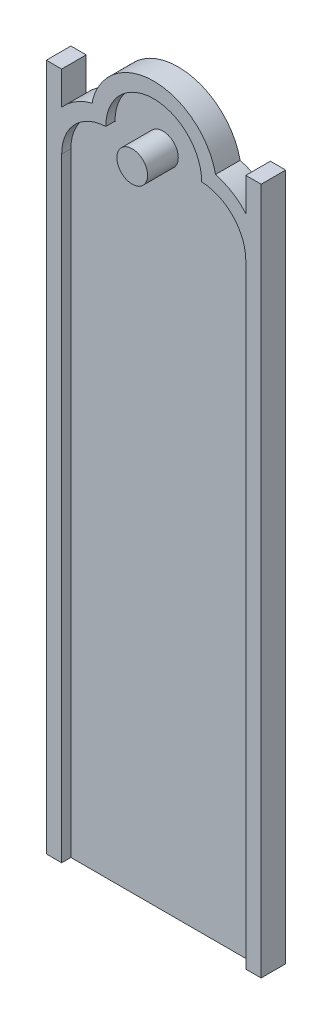
ISO-10303-21;
HEADER;
FILE_DESCRIPTION(('STEP AP214'),'2;1');
FILE_NAME('part.step','',(''),(''),'','','');
FILE_SCHEMA(('AUTOMOTIVE_DESIGN { 1 0 10303 214 1 1 1 1 }'));
ENDSEC;
DATA;
#1=APPLICATION_CONTEXT('core data for automotive mechanical design processes');
#2=APPLICATION_PROTOCOL_DEFINITION('international standard','automotive_design',2000,#1);
#3=PRODUCT_CONTEXT('',#1,'mechanical');
#4=PRODUCT('Part','Part','',(#3));
#5=PRODUCT_RELATED_PRODUCT_CATEGORY('part','',(#4));
#6=PRODUCT_DEFINITION_FORMATION('','',#4);
#7=PRODUCT_DEFINITION_CONTEXT('part definition',#1,'design');
#8=PRODUCT_DEFINITION('design','',#6,#7);
#9=PRODUCT_DEFINITION_SHAPE('','',#8);
#10=(LENGTH_UNIT() NAMED_UNIT(*) SI_UNIT(.MILLI.,.METRE.));
#11=(NAMED_UNIT(*) PLANE_ANGLE_UNIT() SI_UNIT($,.RADIAN.));
#12=(NAMED_UNIT(*) SI_UNIT($,.STERADIAN.) SOLID_ANGLE_UNIT());
#13=UNCERTAINTY_MEASURE_WITH_UNIT(LENGTH_MEASURE(1.E-05),#10,'distance_accuracy_value','');
#14=(GEOMETRIC_REPRESENTATION_CONTEXT(3) GLOBAL_UNCERTAINTY_ASSIGNED_CONTEXT((#13)) GLOBAL_UNIT_ASSIGNED_CONTEXT((#10,
#11,#12)) REPRESENTATION_CONTEXT('',''));
#15=CARTESIAN_POINT('',(0.,0.,0.));
#16=DIRECTION('',(0.,0.,1.));
#17=DIRECTION('',(1.,0.,0.));
#18=AXIS2_PLACEMENT_3D('',#15,#16,#17);
#19=CARTESIAN_POINT('',(0.,637.937190164897,50.));
#20=DIRECTION('',(0.,1.,0.));
#21=DIRECTION('',(0.,0.,1.));
#22=AXIS2_PLACEMENT_3D('',#19,#20,#21);
#23=PLANE('',#22);
#24=DIRECTION('',(1.,0.,0.));
#25=VECTOR('',#24,1.);
#26=CARTESIAN_POINT('',(0.,637.937190164897,0.));
#27=LINE('',#26,#25);
#28=CARTESIAN_POINT('',(166.218098660112,637.937190164897,0.));
#29=VERTEX_POINT('',#28);
#30=CARTESIAN_POINT('',(172.373379940995,637.937190164897,0.));
#31=VERTEX_POINT('',#30);
#32=EDGE_CURVE('E369',#29,#31,#27,.T.);
#33=ORIENTED_EDGE('',*,*,#32,.T.);
#34=DIRECTION('',(0.,0.,-1.));
#35=VECTOR('',#34,1.);
#36=CARTESIAN_POINT('',(172.373379940995,637.937190164897,50.));
#37=LINE('',#36,#35);
#38=CARTESIAN_POINT('',(172.373379940995,637.937190164897,50.));
#39=VERTEX_POINT('',#38);
#40=EDGE_CURVE('E11',#39,#31,#37,.T.);
#41=ORIENTED_EDGE('',*,*,#40,.F.);
#42=DIRECTION('',(1.,0.,0.));
#43=VECTOR('',#42,1.);
#44=CARTESIAN_POINT('',(0.,637.937190164897,50.));
#45=LINE('',#44,#43);
#46=CARTESIAN_POINT('',(166.218098660112,637.937190164897,50.));
#47=VERTEX_POINT('',#46);
#48=EDGE_CURVE('E374',#47,#39,#45,.T.);
#49=ORIENTED_EDGE('',*,*,#48,.F.);
#50=DIRECTION('',(0.,0.,-1.));
#51=VECTOR('',#50,1.);
#52=CARTESIAN_POINT('',(166.218098660112,637.937190164897,50.));
#53=LINE('',#52,#51);
#54=EDGE_CURVE('E403',#47,#29,#53,.T.);
#55=ORIENTED_EDGE('',*,*,#54,.T.);
#56=EDGE_LOOP('',(#33,#41,#49,#55));
#57=FACE_BOUND('',#56,.T.);
#58=ADVANCED_FACE('F44',(#57),#23,.F.);
#59=CARTESIAN_POINT('',(0.,637.937190164897,50.));
#60=DIRECTION('',(0.,-1.,0.));
#61=DIRECTION('',(0.,0.,-1.));
#62=AXIS2_PLACEMENT_3D('',#59,#60,#61);
#63=PLANE('',#62);
#64=DIRECTION('',(-1.,0.,0.));
#65=VECTOR('',#64,1.);
#66=CARTESIAN_POINT('',(0.,637.937190164897,0.));
#67=LINE('',#66,#65);
#68=CARTESIAN_POINT('',(-133.781901339888,637.937190164897,0.));
#69=VERTEX_POINT('',#68);
#70=CARTESIAN_POINT('',(-139.937182620771,637.937190164897,0.));
#71=VERTEX_POINT('',#70);
#72=EDGE_CURVE('E406',#69,#71,#67,.T.);
#73=ORIENTED_EDGE('',*,*,#72,.F.);
#74=DIRECTION('',(0.,0.,-1.));
#75=VECTOR('',#74,1.);
#76=CARTESIAN_POINT('',(-133.781901339888,637.937190164897,50.));
#77=LINE('',#76,#75);
#78=CARTESIAN_POINT('',(-133.781901339888,637.937190164897,50.));
#79=VERTEX_POINT('',#78);
#80=EDGE_CURVE('E419',#79,#69,#77,.T.);
#81=ORIENTED_EDGE('',*,*,#80,.F.);
#82=DIRECTION('',(-1.,0.,0.));
#83=VECTOR('',#82,1.);
#84=CARTESIAN_POINT('',(0.,637.937190164897,50.));
#85=LINE('',#84,#83);
#86=CARTESIAN_POINT('',(-139.937182620771,637.937190164897,50.));
#87=VERTEX_POINT('',#86);
#88=EDGE_CURVE('E381',#79,#87,#85,.T.);
#89=ORIENTED_EDGE('',*,*,#88,.T.);
#90=DIRECTION('',(0.,0.,-1.));
#91=VECTOR('',#90,1.);
#92=CARTESIAN_POINT('',(-139.937182620771,637.937190164897,50.));
#93=LINE('',#92,#91);
#94=EDGE_CURVE('E52',#87,#71,#93,.T.);
#95=ORIENTED_EDGE('',*,*,#94,.T.);
#96=EDGE_LOOP('',(#73,#81,#89,#95));
#97=FACE_BOUND('',#96,.T.);
#98=ADVANCED_FACE('F427',(#97),#63,.T.);
#99=CARTESIAN_POINT('',(-133.781901339888,487.937190164897,50.));
#100=DIRECTION('',(0.,0.,-1.));
#101=DIRECTION('',(-1.,0.,0.));
#102=AXIS2_PLACEMENT_3D('',#99,#100,#101);
#103=CYLINDRICAL_SURFACE('',#102,150.);
#104=CARTESIAN_POINT('',(-133.781901339888,487.937190164897,0.));
#105=DIRECTION('',(0.,0.,1.));
#106=DIRECTION('',(1.,0.,0.));
#107=AXIS2_PLACEMENT_3D('',#104,#105,#106);
#108=CIRCLE('',#107,150.);
#109=CARTESIAN_POINT('',(-139.93713150982,637.810847428457,0.));
#110=VERTEX_POINT('',#109);
#111=EDGE_CURVE('E64',#69,#110,#108,.T.);
#112=ORIENTED_EDGE('',*,*,#111,.T.);
#113=DIRECTION('',(0.,0.,-1.));
#114=VECTOR('',#113,1.);
#115=CARTESIAN_POINT('',(-139.93713150982,637.810847428457,80.));
#116=LINE('',#115,#114);
#117=CARTESIAN_POINT('',(-139.93713150982,637.810847428457,50.));
#118=VERTEX_POINT('',#117);
#119=EDGE_CURVE('E59',#118,#110,#116,.T.);
#120=ORIENTED_EDGE('',*,*,#119,.F.);
#121=CARTESIAN_POINT('',(-133.781901339888,487.937190164897,50.));
#122=DIRECTION('',(0.,0.,1.));
#123=DIRECTION('',(1.,0.,0.));
#124=AXIS2_PLACEMENT_3D('',#121,#122,#123);
#125=CIRCLE('',#124,150.);
#126=EDGE_CURVE('E385',#79,#118,#125,.T.);
#127=ORIENTED_EDGE('',*,*,#126,.F.);
#128=ORIENTED_EDGE('',*,*,#80,.T.);
#129=EDGE_LOOP('',(#112,#120,#127,#128));
#130=FACE_BOUND('',#129,.T.);
#131=ADVANCED_FACE('F455',(#130),#103,.T.);
#132=CARTESIAN_POINT('',(0.,-1512.0628098351,50.));
#133=DIRECTION('',(0.,1.,0.));
#134=DIRECTION('',(0.,0.,1.));
#135=AXIS2_PLACEMENT_3D('',#132,#133,#134);
#136=PLANE('',#135);
#137=DIRECTION('',(1.,0.,0.));
#138=VECTOR('',#137,1.);
#139=CARTESIAN_POINT('',(0.,-1512.0628098351,0.));
#140=LINE('',#139,#138);
#141=CARTESIAN_POINT('',(-333.781901339888,-1512.0628098351,0.));
#142=VERTEX_POINT('',#141);
#143=CARTESIAN_POINT('',(366.218098660112,-1512.0628098351,0.));
#144=VERTEX_POINT('',#143);
#145=EDGE_CURVE('E411',#142,#144,#140,.T.);
#146=ORIENTED_EDGE('',*,*,#145,.T.);
#147=DIRECTION('',(0.,0.,-1.));
#148=VECTOR('',#147,1.);
#149=CARTESIAN_POINT('',(366.218098660112,-1512.0628098351,80.));
#150=LINE('',#149,#148);
#151=CARTESIAN_POINT('',(366.218098660112,-1512.0628098351,80.));
#152=VERTEX_POINT('',#151);
#153=EDGE_CURVE('E356',#152,#144,#150,.T.);
#154=ORIENTED_EDGE('',*,*,#153,.F.);
#155=DIRECTION('',(1.,0.,0.));
#156=VECTOR('',#155,1.);
#157=CARTESIAN_POINT('',(0.,-1512.0628098351,80.));
#158=LINE('',#157,#156);
#159=CARTESIAN_POINT('',(316.218098660112,-1512.0628098351,80.));
#160=VERTEX_POINT('',#159);
#161=EDGE_CURVE('E225',#160,#152,#158,.T.);
#162=ORIENTED_EDGE('',*,*,#161,.F.);
#163=DIRECTION('',(0.,0.,-1.));
#164=VECTOR('',#163,1.);
#165=CARTESIAN_POINT('',(316.218098660112,-1512.0628098351,80.));
#166=LINE('',#165,#164);
#167=CARTESIAN_POINT('',(316.218098660112,-1512.0628098351,50.));
#168=VERTEX_POINT('',#167);
#169=EDGE_CURVE('E360',#160,#168,#166,.T.);
#170=ORIENTED_EDGE('',*,*,#169,.T.);
#171=DIRECTION('',(1.,0.,0.));
#172=VECTOR('',#171,1.);
#173=CARTESIAN_POINT('',(0.,-1512.0628098351,50.));
#174=LINE('',#173,#172);
#175=CARTESIAN_POINT('',(-283.781901339888,-1512.0628098351,50.));
#176=VERTEX_POINT('',#175);
#177=EDGE_CURVE('E391',#176,#168,#174,.T.);
#178=ORIENTED_EDGE('',*,*,#177,.F.);
#179=DIRECTION('',(0.,0.,-1.));
#180=VECTOR('',#179,1.);
#181=CARTESIAN_POINT('',(-283.781901339888,-1512.0628098351,80.));
#182=LINE('',#181,#180);
#183=CARTESIAN_POINT('',(-283.781901339888,-1512.0628098351,80.));
#184=VERTEX_POINT('',#183);
#185=EDGE_CURVE('E315',#184,#176,#182,.T.);
#186=ORIENTED_EDGE('',*,*,#185,.F.);
#187=CARTESIAN_POINT('',(-333.781901339888,-1512.0628098351,80.));
#188=VERTEX_POINT('',#187);
#189=EDGE_CURVE('E232',#188,#184,#158,.T.);
#190=ORIENTED_EDGE('',*,*,#189,.F.);
#191=DIRECTION('',(0.,0.,-1.));
#192=VECTOR('',#191,1.);
#193=CARTESIAN_POINT('',(-333.781901339888,-1512.0628098351,80.));
#194=LINE('',#193,#192);
#195=EDGE_CURVE('E319',#188,#142,#194,.T.);
#196=ORIENTED_EDGE('',*,*,#195,.T.);
#197=EDGE_LOOP('',(#146,#154,#162,#170,#178,#186,#190,#196));
#198=FACE_BOUND('',#197,.T.);
#199=ADVANCED_FACE('F474',(#198),#136,.F.);
#200=CARTESIAN_POINT('',(166.218098660112,487.937190164897,50.));
#201=DIRECTION('',(0.,0.,-1.));
#202=DIRECTION('',(-1.,0.,0.));
#203=AXIS2_PLACEMENT_3D('',#200,#201,#202);
#204=CYLINDRICAL_SURFACE('',#203,150.);
#205=CARTESIAN_POINT('',(166.218098660112,487.937190164897,50.));
#206=DIRECTION('',(0.,0.,1.));
#207=DIRECTION('',(1.,0.,0.));
#208=AXIS2_PLACEMENT_3D('',#205,#206,#207);
#209=CIRCLE('',#208,150.);
#210=CARTESIAN_POINT('',(172.373328830045,637.810847428457,50.));
#211=VERTEX_POINT('',#210);
#212=EDGE_CURVE('E398',#211,#47,#209,.T.);
#213=ORIENTED_EDGE('',*,*,#212,.F.);
#214=DIRECTION('',(0.,0.,-1.));
#215=VECTOR('',#214,1.);
#216=CARTESIAN_POINT('',(172.373328830045,637.810847428457,80.));
#217=LINE('',#216,#215);
#218=CARTESIAN_POINT('',(172.373328830045,637.810847428457,0.));
#219=VERTEX_POINT('',#218);
#220=EDGE_CURVE('E200',#211,#219,#217,.T.);
#221=ORIENTED_EDGE('',*,*,#220,.T.);
#222=CARTESIAN_POINT('',(166.218098660112,487.937190164897,0.));
#223=DIRECTION('',(0.,0.,1.));
#224=DIRECTION('',(1.,0.,0.));
#225=AXIS2_PLACEMENT_3D('',#222,#223,#224);
#226=CIRCLE('',#225,150.);
#227=EDGE_CURVE('E375',#219,#29,#226,.T.);
#228=ORIENTED_EDGE('',*,*,#227,.T.);
#229=ORIENTED_EDGE('',*,*,#54,.F.);
#230=EDGE_LOOP('',(#213,#221,#228,#229));
#231=FACE_BOUND('',#230,.T.);
#232=ADVANCED_FACE('F465',(#231),#204,.T.);
#233=CARTESIAN_POINT('',(0.,0.,50.));
#234=DIRECTION('',(0.,0.,1.));
#235=DIRECTION('',(1.,0.,0.));
#236=AXIS2_PLACEMENT_3D('',#233,#234,#235);
#237=PLANE('',#236);
#238=CARTESIAN_POINT('',(16.2180986601124,637.937190164897,50.));
#239=DIRECTION('',(0.,0.,1.));
#240=DIRECTION('',(1.,0.,0.));
#241=AXIS2_PLACEMENT_3D('',#238,#239,#240);
#242=CIRCLE('',#241,50.);
#243=CARTESIAN_POINT('',(66.2180986601123,637.937190164897,50.));
#244=VERTEX_POINT('',#243);
#245=EDGE_CURVE('E370',#244,#244,#242,.T.);
#246=ORIENTED_EDGE('',*,*,#245,.F.);
#247=EDGE_LOOP('',(#246));
#248=FACE_BOUND('',#247,.T.);
#249=ORIENTED_EDGE('',*,*,#48,.T.);
#250=CARTESIAN_POINT('',(16.2180986601124,637.937190164897,50.));
#251=DIRECTION('',(0.,0.,1.));
#252=DIRECTION('',(1.,0.,0.));
#253=AXIS2_PLACEMENT_3D('',#250,#251,#252);
#254=CIRCLE('',#253,156.155281280883);
#255=EDGE_CURVE('E378',#39,#87,#254,.T.);
#256=ORIENTED_EDGE('',*,*,#255,.T.);
#257=ORIENTED_EDGE('',*,*,#88,.F.);
#258=ORIENTED_EDGE('',*,*,#126,.T.);
#259=CARTESIAN_POINT('',(-133.781901339888,487.937190164897,50.));
#260=DIRECTION('',(0.,0.,1.));
#261=DIRECTION('',(1.,0.,0.));
#262=AXIS2_PLACEMENT_3D('',#259,#260,#261);
#263=CIRCLE('',#262,150.);
#264=CARTESIAN_POINT('',(-283.781901339888,487.937190164897,50.));
#265=VERTEX_POINT('',#264);
#266=EDGE_CURVE('E205',#265,#118,#263,.F.);
#267=ORIENTED_EDGE('',*,*,#266,.F.);
#268=DIRECTION('',(0.,-1.,0.));
#269=VECTOR('',#268,1.);
#270=CARTESIAN_POINT('',(-283.781901339888,0.,50.));
#271=LINE('',#270,#269);
#272=EDGE_CURVE('E388',#265,#176,#271,.T.);
#273=ORIENTED_EDGE('',*,*,#272,.T.);
#274=ORIENTED_EDGE('',*,*,#177,.T.);
#275=DIRECTION('',(0.,-1.,0.));
#276=VECTOR('',#275,1.);
#277=CARTESIAN_POINT('',(316.218098660112,0.,50.));
#278=LINE('',#277,#276);
#279=CARTESIAN_POINT('',(316.218098660112,487.937190164897,50.));
#280=VERTEX_POINT('',#279);
#281=EDGE_CURVE('E395',#280,#168,#278,.T.);
#282=ORIENTED_EDGE('',*,*,#281,.F.);
#283=EDGE_CURVE('E399',#280,#211,#209,.T.);
#284=ORIENTED_EDGE('',*,*,#283,.T.);
#285=ORIENTED_EDGE('',*,*,#212,.T.);
#286=EDGE_LOOP('',(#249,#256,#257,#258,#267,#273,#274,#282,#284,#285));
#287=FACE_BOUND('',#286,.T.);
#288=ADVANCED_FACE('F480',(#248,#287),#237,.T.);
#289=CARTESIAN_POINT('',(0.,0.,0.));
#290=DIRECTION('',(0.,0.,1.));
#291=DIRECTION('',(1.,0.,0.));
#292=AXIS2_PLACEMENT_3D('',#289,#290,#291);
#293=PLANE('',#292);
#294=ORIENTED_EDGE('',*,*,#72,.T.);
#295=CARTESIAN_POINT('',(16.2180986601124,637.937190164897,0.));
#296=DIRECTION('',(0.,0.,1.));
#297=DIRECTION('',(1.,0.,0.));
#298=AXIS2_PLACEMENT_3D('',#295,#296,#297);
#299=CIRCLE('',#298,156.155281280883);
#300=EDGE_CURVE('E275',#71,#110,#299,.T.);
#301=ORIENTED_EDGE('',*,*,#300,.T.);
#302=ORIENTED_EDGE('',*,*,#111,.F.);
#303=EDGE_LOOP('',(#294,#301,#302));
#304=FACE_BOUND('',#303,.T.);
#305=ORIENTED_EDGE('',*,*,#227,.F.);
#306=EDGE_CURVE('E270',#219,#31,#299,.T.);
#307=ORIENTED_EDGE('',*,*,#306,.T.);
#308=ORIENTED_EDGE('',*,*,#32,.F.);
#309=EDGE_LOOP('',(#305,#307,#308));
#310=FACE_BOUND('',#309,.T.);
#311=DIRECTION('',(0.,1.,0.));
#312=VECTOR('',#311,1.);
#313=CARTESIAN_POINT('',(366.218098660112,0.,0.));
#314=LINE('',#313,#312);
#315=CARTESIAN_POINT('',(366.218098660112,727.937190164897,0.));
#316=VERTEX_POINT('',#315);
#317=EDGE_CURVE('E274',#144,#316,#314,.T.);
#318=ORIENTED_EDGE('',*,*,#317,.F.);
#319=ORIENTED_EDGE('',*,*,#145,.F.);
#320=DIRECTION('',(0.,1.,0.));
#321=VECTOR('',#320,1.);
#322=CARTESIAN_POINT('',(-333.781901339888,0.,0.));
#323=LINE('',#322,#321);
#324=CARTESIAN_POINT('',(-333.781901339888,727.937190164897,0.));
#325=VERTEX_POINT('',#324);
#326=EDGE_CURVE('E215',#142,#325,#323,.T.);
#327=ORIENTED_EDGE('',*,*,#326,.T.);
#328=DIRECTION('',(-1.,0.,0.));
#329=VECTOR('',#328,1.);
#330=CARTESIAN_POINT('',(0.,727.937190164897,0.));
#331=LINE('',#330,#329);
#332=CARTESIAN_POINT('',(-283.781901339888,727.937190164897,0.));
#333=VERTEX_POINT('',#332);
#334=EDGE_CURVE('E301',#333,#325,#331,.T.);
#335=ORIENTED_EDGE('',*,*,#334,.F.);
#336=DIRECTION('',(0.,-1.,0.));
#337=VECTOR('',#336,1.);
#338=CARTESIAN_POINT('',(-283.781901339888,0.,0.));
#339=LINE('',#338,#337);
#340=CARTESIAN_POINT('',(-283.781901339888,620.224755718126,0.));
#341=VERTEX_POINT('',#340);
#342=EDGE_CURVE('E297',#333,#341,#339,.T.);
#343=ORIENTED_EDGE('',*,*,#342,.T.);
#344=CARTESIAN_POINT('',(-133.781901339888,487.937190164897,0.));
#345=DIRECTION('',(0.,0.,1.));
#346=DIRECTION('',(1.,0.,0.));
#347=AXIS2_PLACEMENT_3D('',#344,#345,#346);
#348=CIRCLE('',#347,200.);
#349=CARTESIAN_POINT('',(-183.781901339888,681.586357475267,0.));
#350=VERTEX_POINT('',#349);
#351=EDGE_CURVE('E293',#350,#341,#348,.T.);
#352=ORIENTED_EDGE('',*,*,#351,.F.);
#353=DIRECTION('',(0.,-1.,0.));
#354=VECTOR('',#353,1.);
#355=CARTESIAN_POINT('',(-183.781901339888,0.,0.));
#356=LINE('',#355,#354);
#357=CARTESIAN_POINT('',(-183.781901339888,687.937190164897,0.));
#358=VERTEX_POINT('',#357);
#359=EDGE_CURVE('E290',#358,#350,#356,.T.);
#360=ORIENTED_EDGE('',*,*,#359,.F.);
#361=CARTESIAN_POINT('',(16.2180986601124,637.937190164897,0.));
#362=DIRECTION('',(0.,0.,1.));
#363=DIRECTION('',(1.,0.,0.));
#364=AXIS2_PLACEMENT_3D('',#361,#362,#363);
#365=CIRCLE('',#364,206.155281280883);
#366=CARTESIAN_POINT('',(217.788355506516,681.174113677966,0.));
#367=VERTEX_POINT('',#366);
#368=EDGE_CURVE('E287',#367,#358,#365,.T.);
#369=ORIENTED_EDGE('',*,*,#368,.F.);
#370=CARTESIAN_POINT('',(166.218098660112,487.937190164897,0.));
#371=DIRECTION('',(0.,0.,1.));
#372=DIRECTION('',(1.,0.,0.));
#373=AXIS2_PLACEMENT_3D('',#370,#371,#372);
#374=CIRCLE('',#373,200.);
#375=CARTESIAN_POINT('',(316.218098660112,620.224755718126,0.));
#376=VERTEX_POINT('',#375);
#377=EDGE_CURVE('E284',#376,#367,#374,.T.);
#378=ORIENTED_EDGE('',*,*,#377,.F.);
#379=DIRECTION('',(0.,-1.,0.));
#380=VECTOR('',#379,1.);
#381=CARTESIAN_POINT('',(316.218098660112,0.,0.));
#382=LINE('',#381,#380);
#383=CARTESIAN_POINT('',(316.218098660112,727.937190164897,0.));
#384=VERTEX_POINT('',#383);
#385=EDGE_CURVE('E281',#384,#376,#382,.T.);
#386=ORIENTED_EDGE('',*,*,#385,.F.);
#387=DIRECTION('',(-1.,0.,0.));
#388=VECTOR('',#387,1.);
#389=CARTESIAN_POINT('',(0.,727.937190164897,0.));
#390=LINE('',#389,#388);
#391=EDGE_CURVE('E278',#316,#384,#390,.T.);
#392=ORIENTED_EDGE('',*,*,#391,.F.);
#393=EDGE_LOOP('',(#318,#319,#327,#335,#343,#352,#360,#369,#378,#386,#392));
#394=FACE_BOUND('',#393,.T.);
#395=ADVANCED_FACE('F462',(#304,#310,#394),#293,.F.);
#396=CARTESIAN_POINT('',(16.2180986601124,637.937190164897,80.));
#397=DIRECTION('',(0.,0.,-1.));
#398=DIRECTION('',(-1.,0.,0.));
#399=AXIS2_PLACEMENT_3D('',#396,#397,#398);
#400=CYLINDRICAL_SURFACE('',#399,156.155281280883);
#401=ORIENTED_EDGE('',*,*,#40,.T.);
#402=ORIENTED_EDGE('',*,*,#306,.F.);
#403=ORIENTED_EDGE('',*,*,#220,.F.);
#404=CARTESIAN_POINT('',(172.373328830045,637.810847428457,80.));
#405=VERTEX_POINT('',#404);
#406=EDGE_CURVE('E193',#405,#211,#217,.T.);
#407=ORIENTED_EDGE('',*,*,#406,.F.);
#408=CARTESIAN_POINT('',(16.2180986601124,637.937190164897,80.));
#409=DIRECTION('',(0.,0.,1.));
#410=DIRECTION('',(1.,0.,0.));
#411=AXIS2_PLACEMENT_3D('',#408,#409,#410);
#412=CIRCLE('',#411,156.155281280883);
#413=CARTESIAN_POINT('',(-139.93713150982,637.810847428457,80.));
#414=VERTEX_POINT('',#413);
#415=EDGE_CURVE('E197',#405,#414,#412,.T.);
#416=ORIENTED_EDGE('',*,*,#415,.T.);
#417=EDGE_CURVE('E308',#414,#118,#116,.T.);
#418=ORIENTED_EDGE('',*,*,#417,.T.);
#419=ORIENTED_EDGE('',*,*,#119,.T.);
#420=ORIENTED_EDGE('',*,*,#300,.F.);
#421=ORIENTED_EDGE('',*,*,#94,.F.);
#422=ORIENTED_EDGE('',*,*,#255,.F.);
#423=EDGE_LOOP('',(#401,#402,#403,#407,#416,#418,#419,#420,#421,#422));
#424=FACE_BOUND('',#423,.T.);
#425=ADVANCED_FACE('F195',(#424),#400,.F.);
#426=CARTESIAN_POINT('',(166.218098660112,487.937190164897,80.));
#427=DIRECTION('',(0.,0.,-1.));
#428=DIRECTION('',(-1.,0.,0.));
#429=AXIS2_PLACEMENT_3D('',#426,#427,#428);
#430=CYLINDRICAL_SURFACE('',#429,150.);
#431=ORIENTED_EDGE('',*,*,#406,.T.);
#432=ORIENTED_EDGE('',*,*,#283,.F.);
#433=DIRECTION('',(0.,0.,-1.));
#434=VECTOR('',#433,1.);
#435=CARTESIAN_POINT('',(316.218098660112,487.937190164897,80.));
#436=LINE('',#435,#434);
#437=CARTESIAN_POINT('',(316.218098660112,487.937190164897,80.));
#438=VERTEX_POINT('',#437);
#439=EDGE_CURVE('E219',#438,#280,#436,.T.);
#440=ORIENTED_EDGE('',*,*,#439,.F.);
#441=CARTESIAN_POINT('',(166.218098660112,487.937190164897,80.));
#442=DIRECTION('',(0.,0.,1.));
#443=DIRECTION('',(1.,0.,0.));
#444=AXIS2_PLACEMENT_3D('',#441,#442,#443);
#445=CIRCLE('',#444,150.);
#446=EDGE_CURVE('E210',#438,#405,#445,.T.);
#447=ORIENTED_EDGE('',*,*,#446,.T.);
#448=EDGE_LOOP('',(#431,#432,#440,#447));
#449=FACE_BOUND('',#448,.T.);
#450=ADVANCED_FACE('F217',(#449),#430,.F.);
#451=CARTESIAN_POINT('',(316.218098660112,0.,80.));
#452=DIRECTION('',(1.,0.,0.));
#453=DIRECTION('',(0.,0.,-1.));
#454=AXIS2_PLACEMENT_3D('',#451,#452,#453);
#455=PLANE('',#454);
#456=ORIENTED_EDGE('',*,*,#281,.T.);
#457=ORIENTED_EDGE('',*,*,#169,.F.);
#458=DIRECTION('',(0.,-1.,0.));
#459=VECTOR('',#458,1.);
#460=CARTESIAN_POINT('',(316.218098660112,0.,80.));
#461=LINE('',#460,#459);
#462=EDGE_CURVE('E222',#438,#160,#461,.T.);
#463=ORIENTED_EDGE('',*,*,#462,.F.);
#464=ORIENTED_EDGE('',*,*,#439,.T.);
#465=EDGE_LOOP('',(#456,#457,#463,#464));
#466=FACE_BOUND('',#465,.T.);
#467=ADVANCED_FACE('F531',(#466),#455,.F.);
#468=CARTESIAN_POINT('',(366.218098660112,0.,80.));
#469=DIRECTION('',(-1.,0.,0.));
#470=DIRECTION('',(0.,0.,1.));
#471=AXIS2_PLACEMENT_3D('',#468,#469,#470);
#472=PLANE('',#471);
#473=ORIENTED_EDGE('',*,*,#317,.T.);
#474=DIRECTION('',(0.,0.,-1.));
#475=VECTOR('',#474,1.);
#476=CARTESIAN_POINT('',(366.218098660112,727.937190164897,80.));
#477=LINE('',#476,#475);
#478=CARTESIAN_POINT('',(366.218098660112,727.937190164897,80.));
#479=VERTEX_POINT('',#478);
#480=EDGE_CURVE('E352',#479,#316,#477,.T.);
#481=ORIENTED_EDGE('',*,*,#480,.F.);
#482=DIRECTION('',(0.,1.,0.));
#483=VECTOR('',#482,1.);
#484=CARTESIAN_POINT('',(366.218098660112,0.,80.));
#485=LINE('',#484,#483);
#486=EDGE_CURVE('E231',#152,#479,#485,.T.);
#487=ORIENTED_EDGE('',*,*,#486,.F.);
#488=ORIENTED_EDGE('',*,*,#153,.T.);
#489=EDGE_LOOP('',(#473,#481,#487,#488));
#490=FACE_BOUND('',#489,.T.);
#491=ADVANCED_FACE('F542',(#490),#472,.F.);
#492=CARTESIAN_POINT('',(0.,727.937190164897,80.));
#493=DIRECTION('',(0.,-1.,0.));
#494=DIRECTION('',(0.,0.,-1.));
#495=AXIS2_PLACEMENT_3D('',#492,#493,#494);
#496=PLANE('',#495);
#497=ORIENTED_EDGE('',*,*,#391,.T.);
#498=DIRECTION('',(0.,0.,-1.));
#499=VECTOR('',#498,1.);
#500=CARTESIAN_POINT('',(316.218098660112,727.937190164897,80.));
#501=LINE('',#500,#499);
#502=CARTESIAN_POINT('',(316.218098660112,727.937190164897,80.));
#503=VERTEX_POINT('',#502);
#504=EDGE_CURVE('E348',#503,#384,#501,.T.);
#505=ORIENTED_EDGE('',*,*,#504,.F.);
#506=DIRECTION('',(-1.,0.,0.));
#507=VECTOR('',#506,1.);
#508=CARTESIAN_POINT('',(0.,727.937190164897,80.));
#509=LINE('',#508,#507);
#510=EDGE_CURVE('E235',#479,#503,#509,.T.);
#511=ORIENTED_EDGE('',*,*,#510,.F.);
#512=ORIENTED_EDGE('',*,*,#480,.T.);
#513=EDGE_LOOP('',(#497,#505,#511,#512));
#514=FACE_BOUND('',#513,.T.);
#515=ADVANCED_FACE('F553',(#514),#496,.F.);
#516=CARTESIAN_POINT('',(316.218098660112,0.,80.));
#517=DIRECTION('',(1.,0.,0.));
#518=DIRECTION('',(0.,0.,-1.));
#519=AXIS2_PLACEMENT_3D('',#516,#517,#518);
#520=PLANE('',#519);
#521=ORIENTED_EDGE('',*,*,#385,.T.);
#522=DIRECTION('',(0.,0.,-1.));
#523=VECTOR('',#522,1.);
#524=CARTESIAN_POINT('',(316.218098660112,620.224755718126,80.));
#525=LINE('',#524,#523);
#526=CARTESIAN_POINT('',(316.218098660112,620.224755718126,80.));
#527=VERTEX_POINT('',#526);
#528=EDGE_CURVE('E344',#527,#376,#525,.T.);
#529=ORIENTED_EDGE('',*,*,#528,.F.);
#530=DIRECTION('',(0.,-1.,0.));
#531=VECTOR('',#530,1.);
#532=CARTESIAN_POINT('',(316.218098660112,0.,80.));
#533=LINE('',#532,#531);
#534=EDGE_CURVE('E238',#503,#527,#533,.T.);
#535=ORIENTED_EDGE('',*,*,#534,.F.);
#536=ORIENTED_EDGE('',*,*,#504,.T.);
#537=EDGE_LOOP('',(#521,#529,#535,#536));
#538=FACE_BOUND('',#537,.T.);
#539=ADVANCED_FACE('F563',(#538),#520,.F.);
#540=CARTESIAN_POINT('',(166.218098660112,487.937190164897,80.));
#541=DIRECTION('',(0.,0.,-1.));
#542=DIRECTION('',(-1.,0.,0.));
#543=AXIS2_PLACEMENT_3D('',#540,#541,#542);
#544=CYLINDRICAL_SURFACE('',#543,200.);
#545=ORIENTED_EDGE('',*,*,#377,.T.);
#546=DIRECTION('',(0.,0.,-1.));
#547=VECTOR('',#546,1.);
#548=CARTESIAN_POINT('',(217.788355506516,681.174113677966,80.));
#549=LINE('',#548,#547);
#550=CARTESIAN_POINT('',(217.788355506516,681.174113677966,80.));
#551=VERTEX_POINT('',#550);
#552=EDGE_CURVE('E340',#551,#367,#549,.T.);
#553=ORIENTED_EDGE('',*,*,#552,.F.);
#554=CARTESIAN_POINT('',(166.218098660112,487.937190164897,80.));
#555=DIRECTION('',(0.,0.,1.));
#556=DIRECTION('',(1.,0.,0.));
#557=AXIS2_PLACEMENT_3D('',#554,#555,#556);
#558=CIRCLE('',#557,200.);
#559=EDGE_CURVE('E241',#527,#551,#558,.T.);
#560=ORIENTED_EDGE('',*,*,#559,.F.);
#561=ORIENTED_EDGE('',*,*,#528,.T.);
#562=EDGE_LOOP('',(#545,#553,#560,#561));
#563=FACE_BOUND('',#562,.T.);
#564=ADVANCED_FACE('F574',(#563),#544,.T.);
#565=CARTESIAN_POINT('',(16.2180986601124,637.937190164897,80.));
#566=DIRECTION('',(0.,0.,-1.));
#567=DIRECTION('',(-1.,0.,0.));
#568=AXIS2_PLACEMENT_3D('',#565,#566,#567);
#569=CYLINDRICAL_SURFACE('',#568,206.155281280883);
#570=ORIENTED_EDGE('',*,*,#368,.T.);
#571=DIRECTION('',(0.,0.,-1.));
#572=VECTOR('',#571,1.);
#573=CARTESIAN_POINT('',(-183.781901339888,687.937190164897,80.));
#574=LINE('',#573,#572);
#575=CARTESIAN_POINT('',(-183.781901339888,687.937190164897,80.));
#576=VERTEX_POINT('',#575);
#577=EDGE_CURVE('E336',#576,#358,#574,.T.);
#578=ORIENTED_EDGE('',*,*,#577,.F.);
#579=CARTESIAN_POINT('',(16.2180986601124,637.937190164897,80.));
#580=DIRECTION('',(0.,0.,1.));
#581=DIRECTION('',(1.,0.,0.));
#582=AXIS2_PLACEMENT_3D('',#579,#580,#581);
#583=CIRCLE('',#582,206.155281280883);
#584=EDGE_CURVE('E244',#551,#576,#583,.T.);
#585=ORIENTED_EDGE('',*,*,#584,.F.);
#586=ORIENTED_EDGE('',*,*,#552,.T.);
#587=EDGE_LOOP('',(#570,#578,#585,#586));
#588=FACE_BOUND('',#587,.T.);
#589=ADVANCED_FACE('F585',(#588),#569,.T.);
#590=CARTESIAN_POINT('',(-183.781901339888,0.,80.));
#591=DIRECTION('',(1.,0.,0.));
#592=DIRECTION('',(0.,0.,-1.));
#593=AXIS2_PLACEMENT_3D('',#590,#591,#592);
#594=PLANE('',#593);
#595=ORIENTED_EDGE('',*,*,#359,.T.);
#596=DIRECTION('',(0.,0.,-1.));
#597=VECTOR('',#596,1.);
#598=CARTESIAN_POINT('',(-183.781901339888,681.586357475267,80.));
#599=LINE('',#598,#597);
#600=CARTESIAN_POINT('',(-183.781901339888,681.586357475267,80.));
#601=VERTEX_POINT('',#600);
#602=EDGE_CURVE('E332',#601,#350,#599,.T.);
#603=ORIENTED_EDGE('',*,*,#602,.F.);
#604=DIRECTION('',(0.,-1.,0.));
#605=VECTOR('',#604,1.);
#606=CARTESIAN_POINT('',(-183.781901339888,0.,80.));
#607=LINE('',#606,#605);
#608=EDGE_CURVE('E247',#576,#601,#607,.T.);
#609=ORIENTED_EDGE('',*,*,#608,.F.);
#610=ORIENTED_EDGE('',*,*,#577,.T.);
#611=EDGE_LOOP('',(#595,#603,#609,#610));
#612=FACE_BOUND('',#611,.T.);
#613=ADVANCED_FACE('F596',(#612),#594,.F.);
#614=CARTESIAN_POINT('',(-133.781901339888,487.937190164897,80.));
#615=DIRECTION('',(0.,0.,-1.));
#616=DIRECTION('',(-1.,0.,0.));
#617=AXIS2_PLACEMENT_3D('',#614,#615,#616);
#618=CYLINDRICAL_SURFACE('',#617,200.);
#619=ORIENTED_EDGE('',*,*,#351,.T.);
#620=DIRECTION('',(0.,0.,-1.));
#621=VECTOR('',#620,1.);
#622=CARTESIAN_POINT('',(-283.781901339888,620.224755718126,80.));
#623=LINE('',#622,#621);
#624=CARTESIAN_POINT('',(-283.781901339888,620.224755718126,80.));
#625=VERTEX_POINT('',#624);
#626=EDGE_CURVE('E329',#625,#341,#623,.T.);
#627=ORIENTED_EDGE('',*,*,#626,.F.);
#628=CARTESIAN_POINT('',(-133.781901339888,487.937190164897,80.));
#629=DIRECTION('',(0.,0.,1.));
#630=DIRECTION('',(1.,0.,0.));
#631=AXIS2_PLACEMENT_3D('',#628,#629,#630);
#632=CIRCLE('',#631,200.);
#633=EDGE_CURVE('E250',#601,#625,#632,.T.);
#634=ORIENTED_EDGE('',*,*,#633,.F.);
#635=ORIENTED_EDGE('',*,*,#602,.T.);
#636=EDGE_LOOP('',(#619,#627,#634,#635));
#637=FACE_BOUND('',#636,.T.);
#638=ADVANCED_FACE('F608',(#637),#618,.T.);
#639=CARTESIAN_POINT('',(-283.781901339888,0.,80.));
#640=DIRECTION('',(1.,0.,0.));
#641=DIRECTION('',(0.,0.,-1.));
#642=AXIS2_PLACEMENT_3D('',#639,#640,#641);
#643=PLANE('',#642);
#644=ORIENTED_EDGE('',*,*,#342,.F.);
#645=DIRECTION('',(0.,0.,-1.));
#646=VECTOR('',#645,1.);
#647=CARTESIAN_POINT('',(-283.781901339888,727.937190164897,80.));
#648=LINE('',#647,#646);
#649=CARTESIAN_POINT('',(-283.781901339888,727.937190164897,80.));
#650=VERTEX_POINT('',#649);
#651=EDGE_CURVE('E326',#650,#333,#648,.T.);
#652=ORIENTED_EDGE('',*,*,#651,.F.);
#653=DIRECTION('',(0.,-1.,0.));
#654=VECTOR('',#653,1.);
#655=CARTESIAN_POINT('',(-283.781901339888,0.,80.));
#656=LINE('',#655,#654);
#657=EDGE_CURVE('E253',#650,#625,#656,.T.);
#658=ORIENTED_EDGE('',*,*,#657,.T.);
#659=ORIENTED_EDGE('',*,*,#626,.T.);
#660=EDGE_LOOP('',(#644,#652,#658,#659));
#661=FACE_BOUND('',#660,.T.);
#662=ADVANCED_FACE('F618',(#661),#643,.T.);
#663=CARTESIAN_POINT('',(0.,727.937190164897,80.));
#664=DIRECTION('',(0.,-1.,0.));
#665=DIRECTION('',(0.,0.,-1.));
#666=AXIS2_PLACEMENT_3D('',#663,#664,#665);
#667=PLANE('',#666);
#668=ORIENTED_EDGE('',*,*,#334,.T.);
#669=DIRECTION('',(0.,0.,-1.));
#670=VECTOR('',#669,1.);
#671=CARTESIAN_POINT('',(-333.781901339888,727.937190164897,80.));
#672=LINE('',#671,#670);
#673=CARTESIAN_POINT('',(-333.781901339888,727.937190164897,80.));
#674=VERTEX_POINT('',#673);
#675=EDGE_CURVE('E323',#674,#325,#672,.T.);
#676=ORIENTED_EDGE('',*,*,#675,.F.);
#677=DIRECTION('',(-1.,0.,0.));
#678=VECTOR('',#677,1.);
#679=CARTESIAN_POINT('',(0.,727.937190164897,80.));
#680=LINE('',#679,#678);
#681=EDGE_CURVE('E257',#650,#674,#680,.T.);
#682=ORIENTED_EDGE('',*,*,#681,.F.);
#683=ORIENTED_EDGE('',*,*,#651,.T.);
#684=EDGE_LOOP('',(#668,#676,#682,#683));
#685=FACE_BOUND('',#684,.T.);
#686=ADVANCED_FACE('F629',(#685),#667,.F.);
#687=CARTESIAN_POINT('',(-333.781901339888,0.,80.));
#688=DIRECTION('',(-1.,0.,0.));
#689=DIRECTION('',(0.,0.,1.));
#690=AXIS2_PLACEMENT_3D('',#687,#688,#689);
#691=PLANE('',#690);
#692=ORIENTED_EDGE('',*,*,#326,.F.);
#693=ORIENTED_EDGE('',*,*,#195,.F.);
#694=DIRECTION('',(0.,1.,0.));
#695=VECTOR('',#694,1.);
#696=CARTESIAN_POINT('',(-333.781901339888,0.,80.));
#697=LINE('',#696,#695);
#698=EDGE_CURVE('E260',#188,#674,#697,.T.);
#699=ORIENTED_EDGE('',*,*,#698,.T.);
#700=ORIENTED_EDGE('',*,*,#675,.T.);
#701=EDGE_LOOP('',(#692,#693,#699,#700));
#702=FACE_BOUND('',#701,.T.);
#703=ADVANCED_FACE('F640',(#702),#691,.T.);
#704=CARTESIAN_POINT('',(-283.781901339888,0.,80.));
#705=DIRECTION('',(1.,0.,0.));
#706=DIRECTION('',(0.,0.,-1.));
#707=AXIS2_PLACEMENT_3D('',#704,#705,#706);
#708=PLANE('',#707);
#709=ORIENTED_EDGE('',*,*,#185,.T.);
#710=ORIENTED_EDGE('',*,*,#272,.F.);
#711=DIRECTION('',(0.,0.,-1.));
#712=VECTOR('',#711,1.);
#713=CARTESIAN_POINT('',(-283.781901339888,487.937190164897,80.));
#714=LINE('',#713,#712);
#715=CARTESIAN_POINT('',(-283.781901339888,487.937190164897,80.));
#716=VERTEX_POINT('',#715);
#717=EDGE_CURVE('E311',#716,#265,#714,.T.);
#718=ORIENTED_EDGE('',*,*,#717,.F.);
#719=DIRECTION('',(0.,-1.,0.));
#720=VECTOR('',#719,1.);
#721=CARTESIAN_POINT('',(-283.781901339888,0.,80.));
#722=LINE('',#721,#720);
#723=EDGE_CURVE('E264',#716,#184,#722,.T.);
#724=ORIENTED_EDGE('',*,*,#723,.T.);
#725=EDGE_LOOP('',(#709,#710,#718,#724));
#726=FACE_BOUND('',#725,.T.);
#727=ADVANCED_FACE('F477',(#726),#708,.T.);
#728=CARTESIAN_POINT('',(-133.781901339888,487.937190164897,80.));
#729=DIRECTION('',(0.,0.,-1.));
#730=DIRECTION('',(-1.,0.,0.));
#731=AXIS2_PLACEMENT_3D('',#728,#729,#730);
#732=CYLINDRICAL_SURFACE('',#731,150.);
#733=ORIENTED_EDGE('',*,*,#717,.T.);
#734=ORIENTED_EDGE('',*,*,#266,.T.);
#735=ORIENTED_EDGE('',*,*,#417,.F.);
#736=CARTESIAN_POINT('',(-133.781901339888,487.937190164897,80.));
#737=DIRECTION('',(0.,0.,1.));
#738=DIRECTION('',(1.,0.,0.));
#739=AXIS2_PLACEMENT_3D('',#736,#737,#738);
#740=CIRCLE('',#739,150.);
#741=EDGE_CURVE('E213',#414,#716,#740,.T.);
#742=ORIENTED_EDGE('',*,*,#741,.T.);
#743=EDGE_LOOP('',(#733,#734,#735,#742));
#744=FACE_BOUND('',#743,.T.);
#745=ADVANCED_FACE('F448',(#744),#732,.F.);
#746=CARTESIAN_POINT('',(0.,0.,80.));
#747=DIRECTION('',(0.,0.,1.));
#748=DIRECTION('',(1.,0.,0.));
#749=AXIS2_PLACEMENT_3D('',#746,#747,#748);
#750=PLANE('',#749);
#751=ORIENTED_EDGE('',*,*,#415,.F.);
#752=ORIENTED_EDGE('',*,*,#446,.F.);
#753=ORIENTED_EDGE('',*,*,#462,.T.);
#754=ORIENTED_EDGE('',*,*,#161,.T.);
#755=ORIENTED_EDGE('',*,*,#486,.T.);
#756=ORIENTED_EDGE('',*,*,#510,.T.);
#757=ORIENTED_EDGE('',*,*,#534,.T.);
#758=ORIENTED_EDGE('',*,*,#559,.T.);
#759=ORIENTED_EDGE('',*,*,#584,.T.);
#760=ORIENTED_EDGE('',*,*,#608,.T.);
#761=ORIENTED_EDGE('',*,*,#633,.T.);
#762=ORIENTED_EDGE('',*,*,#657,.F.);
#763=ORIENTED_EDGE('',*,*,#681,.T.);
#764=ORIENTED_EDGE('',*,*,#698,.F.);
#765=ORIENTED_EDGE('',*,*,#189,.T.);
#766=ORIENTED_EDGE('',*,*,#723,.F.);
#767=ORIENTED_EDGE('',*,*,#741,.F.);
#768=EDGE_LOOP('',(#751,#752,#753,#754,#755,#756,#757,#758,#759,#760,#761,#762,#763,#764,#765,
#766,#767));
#769=FACE_BOUND('',#768,.T.);
#770=ADVANCED_FACE('F209',(#769),#750,.T.);
#771=CARTESIAN_POINT('',(16.2180986601124,637.937190164897,150.));
#772=DIRECTION('',(0.,0.,-1.));
#773=DIRECTION('',(-1.,0.,0.));
#774=AXIS2_PLACEMENT_3D('',#771,#772,#773);
#775=CYLINDRICAL_SURFACE('',#774,50.);
#776=ORIENTED_EDGE('',*,*,#245,.T.);
#777=EDGE_LOOP('',(#776));
#778=FACE_BOUND('',#777,.T.);
#779=CARTESIAN_POINT('',(16.2180986601124,637.937190164897,150.));
#780=DIRECTION('',(0.,0.,1.));
#781=DIRECTION('',(1.,0.,0.));
#782=AXIS2_PLACEMENT_3D('',#779,#780,#781);
#783=CIRCLE('',#782,50.);
#784=CARTESIAN_POINT('',(66.2180986601123,637.937190164897,150.));
#785=VERTEX_POINT('',#784);
#786=EDGE_CURVE('E432',#785,#785,#783,.T.);
#787=ORIENTED_EDGE('',*,*,#786,.F.);
#788=EDGE_LOOP('',(#787));
#789=FACE_BOUND('',#788,.T.);
#790=ADVANCED_FACE('F439',(#778,#789),#775,.T.);
#791=CARTESIAN_POINT('',(0.,0.,150.));
#792=DIRECTION('',(0.,0.,1.));
#793=DIRECTION('',(1.,0.,0.));
#794=AXIS2_PLACEMENT_3D('',#791,#792,#793);
#795=PLANE('',#794);
#796=ORIENTED_EDGE('',*,*,#786,.T.);
#797=EDGE_LOOP('',(#796));
#798=FACE_BOUND('',#797,.T.);
#799=ADVANCED_FACE('F437',(#798),#795,.T.);
#800=CLOSED_SHELL('',(#58,#98,#131,#199,#232,#288,#395,#425,#450,#467,#491,#515,#539,#564,#589,
#613,#638,#662,#686,#703,#727,#745,#770,#790,#799));
#801=MANIFOLD_SOLID_BREP('B2',#800);
#802=ADVANCED_BREP_SHAPE_REPRESENTATION('',(#18,#801),#14);
#803=SHAPE_DEFINITION_REPRESENTATION(#9,#802);
ENDSEC;
END-ISO-10303-21;
